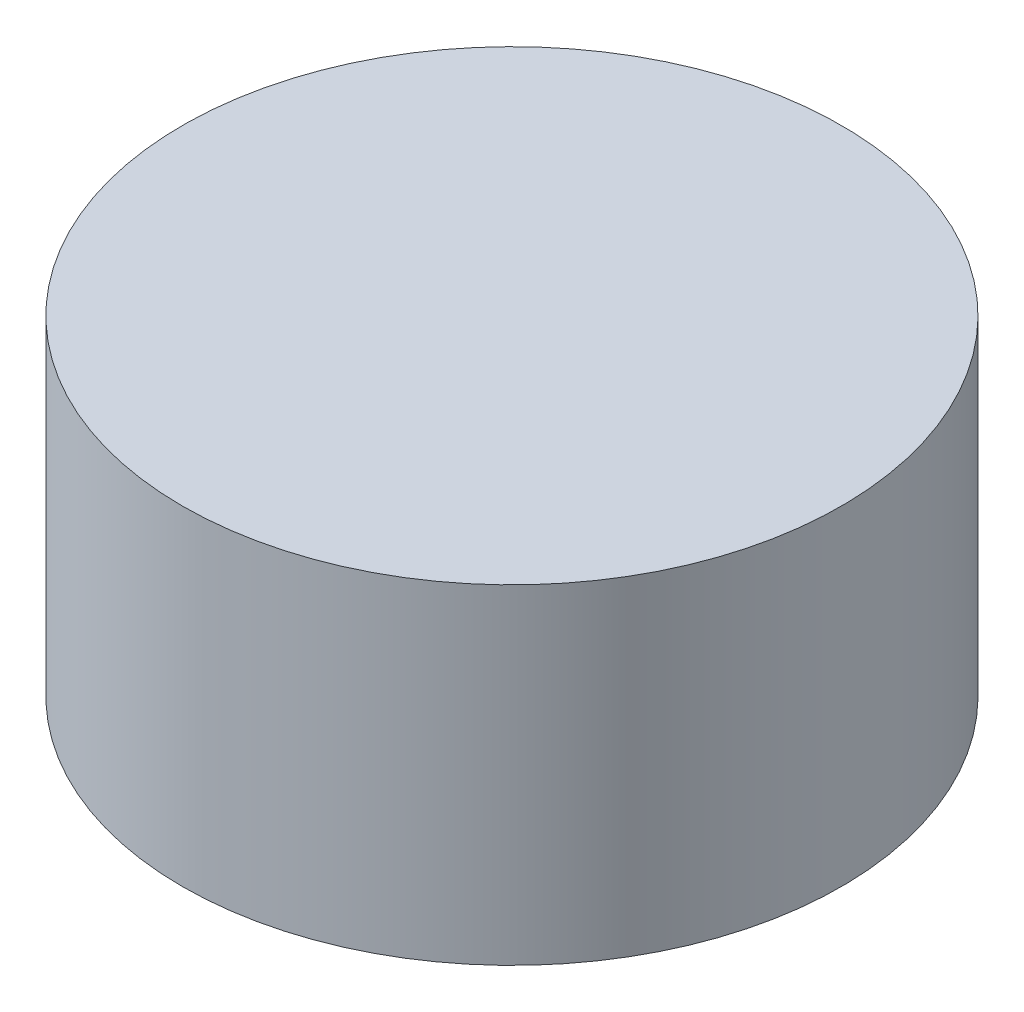
ISO-10303-21;
HEADER;
FILE_DESCRIPTION(('STEP AP214'),'2;1');
FILE_NAME('part.step','',(''),(''),'','','');
FILE_SCHEMA(('AUTOMOTIVE_DESIGN { 1 0 10303 214 1 1 1 1 }'));
ENDSEC;
DATA;
#1=APPLICATION_CONTEXT('core data for automotive mechanical design processes');
#2=APPLICATION_PROTOCOL_DEFINITION('international standard','automotive_design',2000,#1);
#3=PRODUCT_CONTEXT('',#1,'mechanical');
#4=PRODUCT('Part','Part','',(#3));
#5=PRODUCT_RELATED_PRODUCT_CATEGORY('part','',(#4));
#6=PRODUCT_DEFINITION_FORMATION('','',#4);
#7=PRODUCT_DEFINITION_CONTEXT('part definition',#1,'design');
#8=PRODUCT_DEFINITION('design','',#6,#7);
#9=PRODUCT_DEFINITION_SHAPE('','',#8);
#10=(LENGTH_UNIT() NAMED_UNIT(*) SI_UNIT(.MILLI.,.METRE.));
#11=(NAMED_UNIT(*) PLANE_ANGLE_UNIT() SI_UNIT($,.RADIAN.));
#12=(NAMED_UNIT(*) SI_UNIT($,.STERADIAN.) SOLID_ANGLE_UNIT());
#13=UNCERTAINTY_MEASURE_WITH_UNIT(LENGTH_MEASURE(1.E-05),#10,'distance_accuracy_value','');
#14=(GEOMETRIC_REPRESENTATION_CONTEXT(3) GLOBAL_UNCERTAINTY_ASSIGNED_CONTEXT((#13)) GLOBAL_UNIT_ASSIGNED_CONTEXT((#10,
#11,#12)) REPRESENTATION_CONTEXT('',''));
#15=CARTESIAN_POINT('',(0.,0.,0.));
#16=DIRECTION('',(0.,0.,1.));
#17=DIRECTION('',(1.,0.,0.));
#18=AXIS2_PLACEMENT_3D('',#15,#16,#17);
#19=CARTESIAN_POINT('',(0.,50.,0.));
#20=DIRECTION('',(0.,-1.,0.));
#21=DIRECTION('',(0.,0.,-1.));
#22=AXIS2_PLACEMENT_3D('',#19,#20,#21);
#23=CYLINDRICAL_SURFACE('',#22,50.);
#24=CARTESIAN_POINT('',(0.,50.,0.));
#25=DIRECTION('',(0.,1.,0.));
#26=DIRECTION('',(0.,0.,1.));
#27=AXIS2_PLACEMENT_3D('',#24,#25,#26);
#28=CIRCLE('',#27,50.);
#29=CARTESIAN_POINT('',(0.,50.,50.));
#30=VERTEX_POINT('',#29);
#31=EDGE_CURVE('E10',#30,#30,#28,.T.);
#32=ORIENTED_EDGE('',*,*,#31,.F.);
#33=EDGE_LOOP('',(#32));
#34=FACE_BOUND('',#33,.T.);
#35=CARTESIAN_POINT('',(0.,0.,0.));
#36=DIRECTION('',(0.,1.,0.));
#37=DIRECTION('',(0.,0.,1.));
#38=AXIS2_PLACEMENT_3D('',#35,#36,#37);
#39=CIRCLE('',#38,50.);
#40=CARTESIAN_POINT('',(0.,0.,50.));
#41=VERTEX_POINT('',#40);
#42=EDGE_CURVE('E33',#41,#41,#39,.T.);
#43=ORIENTED_EDGE('',*,*,#42,.T.);
#44=EDGE_LOOP('',(#43));
#45=FACE_BOUND('',#44,.T.);
#46=ADVANCED_FACE('F30',(#34,#45),#23,.T.);
#47=CARTESIAN_POINT('',(0.,50.,0.));
#48=DIRECTION('',(0.,1.,0.));
#49=DIRECTION('',(0.,0.,1.));
#50=AXIS2_PLACEMENT_3D('',#47,#48,#49);
#51=PLANE('',#50);
#52=ORIENTED_EDGE('',*,*,#31,.T.);
#53=EDGE_LOOP('',(#52));
#54=FACE_BOUND('',#53,.T.);
#55=ADVANCED_FACE('F45',(#54),#51,.T.);
#56=CARTESIAN_POINT('',(0.,0.,0.));
#57=DIRECTION('',(0.,1.,0.));
#58=DIRECTION('',(0.,0.,1.));
#59=AXIS2_PLACEMENT_3D('',#56,#57,#58);
#60=PLANE('',#59);
#61=ORIENTED_EDGE('',*,*,#42,.F.);
#62=EDGE_LOOP('',(#61));
#63=FACE_BOUND('',#62,.T.);
#64=ADVANCED_FACE('F43',(#63),#60,.F.);
#65=CLOSED_SHELL('',(#46,#55,#64));
#66=MANIFOLD_SOLID_BREP('B2',#65);
#67=ADVANCED_BREP_SHAPE_REPRESENTATION('',(#18,#66),#14);
#68=SHAPE_DEFINITION_REPRESENTATION(#9,#67);
ENDSEC;
END-ISO-10303-21;
